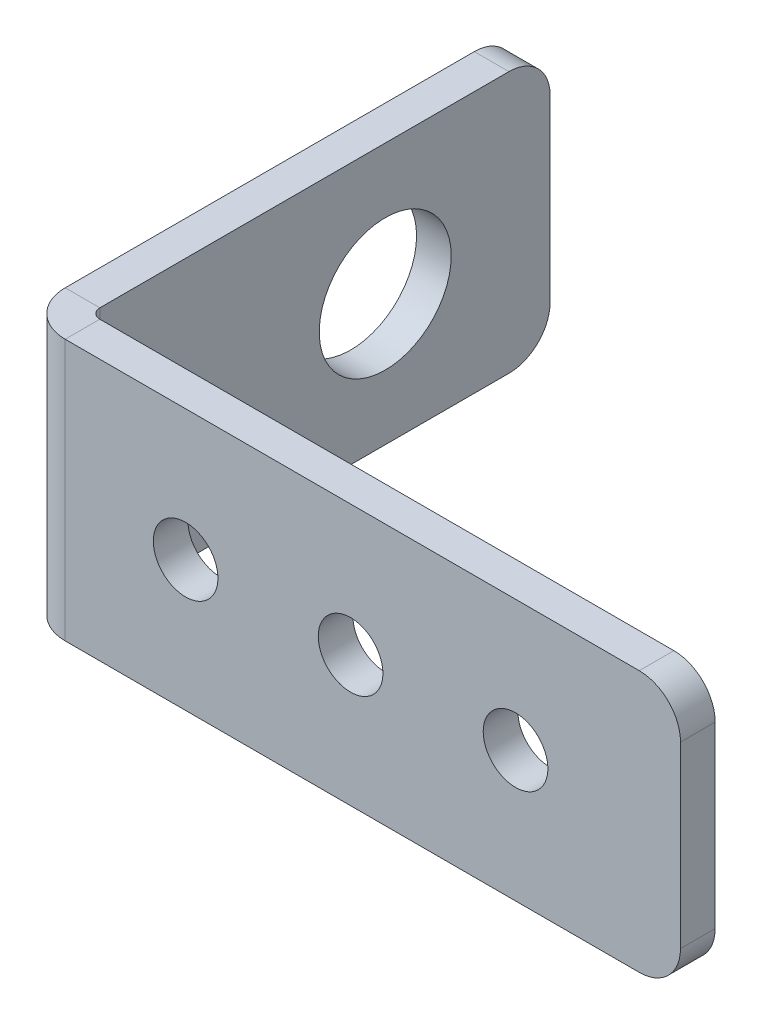
ISO-10303-21;
HEADER;
FILE_DESCRIPTION(('STEP AP214'),'2;1');
FILE_NAME('part.step','',(''),(''),'','','');
FILE_SCHEMA(('AUTOMOTIVE_DESIGN { 1 0 10303 214 1 1 1 1 }'));
ENDSEC;
DATA;
#1=APPLICATION_CONTEXT('core data for automotive mechanical design processes');
#2=APPLICATION_PROTOCOL_DEFINITION('international standard','automotive_design',2000,#1);
#3=PRODUCT_CONTEXT('',#1,'mechanical');
#4=PRODUCT('Part','Part','',(#3));
#5=PRODUCT_RELATED_PRODUCT_CATEGORY('part','',(#4));
#6=PRODUCT_DEFINITION_FORMATION('','',#4);
#7=PRODUCT_DEFINITION_CONTEXT('part definition',#1,'design');
#8=PRODUCT_DEFINITION('design','',#6,#7);
#9=PRODUCT_DEFINITION_SHAPE('','',#8);
#10=(LENGTH_UNIT() NAMED_UNIT(*) SI_UNIT(.MILLI.,.METRE.));
#11=(NAMED_UNIT(*) PLANE_ANGLE_UNIT() SI_UNIT($,.RADIAN.));
#12=(NAMED_UNIT(*) SI_UNIT($,.STERADIAN.) SOLID_ANGLE_UNIT());
#13=UNCERTAINTY_MEASURE_WITH_UNIT(LENGTH_MEASURE(1.E-05),#10,'distance_accuracy_value','');
#14=(GEOMETRIC_REPRESENTATION_CONTEXT(3) GLOBAL_UNCERTAINTY_ASSIGNED_CONTEXT((#13)) GLOBAL_UNIT_ASSIGNED_CONTEXT((#10,
#11,#12)) REPRESENTATION_CONTEXT('',''));
#15=CARTESIAN_POINT('',(0.,0.,0.));
#16=DIRECTION('',(0.,0.,1.));
#17=DIRECTION('',(1.,0.,0.));
#18=AXIS2_PLACEMENT_3D('',#15,#16,#17);
#19=CARTESIAN_POINT('',(0.,20.1168,-3.429));
#20=DIRECTION('',(0.,1.,0.));
#21=DIRECTION('',(0.,0.,1.));
#22=AXIS2_PLACEMENT_3D('',#19,#20,#21);
#23=PLANE('',#22);
#24=DIRECTION('',(1.,0.,0.));
#25=VECTOR('',#24,1.);
#26=CARTESIAN_POINT('',(0.,20.1168,-3.429));
#27=LINE('',#26,#25);
#28=CARTESIAN_POINT('',(0.,20.1168,-3.429));
#29=VERTEX_POINT('',#28);
#30=CARTESIAN_POINT('',(2.667,20.1168,-3.429));
#31=VERTEX_POINT('',#30);
#32=EDGE_CURVE('E138',#29,#31,#27,.T.);
#33=ORIENTED_EDGE('',*,*,#32,.F.);
#34=CARTESIAN_POINT('',(3.429,20.1168,-3.429));
#35=DIRECTION('',(0.,-1.,0.));
#36=DIRECTION('',(0.,0.,-1.));
#37=AXIS2_PLACEMENT_3D('',#34,#35,#36);
#38=CIRCLE('',#37,3.429);
#39=CARTESIAN_POINT('',(3.429,20.1168,0.));
#40=VERTEX_POINT('',#39);
#41=EDGE_CURVE('E133',#29,#40,#38,.F.);
#42=ORIENTED_EDGE('',*,*,#41,.T.);
#43=DIRECTION('',(0.,0.,1.));
#44=VECTOR('',#43,1.);
#45=CARTESIAN_POINT('',(3.429,20.1168,-2.667));
#46=LINE('',#45,#44);
#47=CARTESIAN_POINT('',(3.429,20.1168,-2.667));
#48=VERTEX_POINT('',#47);
#49=EDGE_CURVE('E127',#48,#40,#46,.T.);
#50=ORIENTED_EDGE('',*,*,#49,.F.);
#51=CARTESIAN_POINT('',(3.429,20.1168,-3.429));
#52=DIRECTION('',(0.,1.,0.));
#53=DIRECTION('',(1.,0.,0.));
#54=AXIS2_PLACEMENT_3D('',#51,#52,#53);
#55=CIRCLE('',#54,0.762);
#56=EDGE_CURVE('E131',#31,#48,#55,.T.);
#57=ORIENTED_EDGE('',*,*,#56,.F.);
#58=EDGE_LOOP('',(#33,#42,#50,#57));
#59=FACE_BOUND('',#58,.T.);
#60=ADVANCED_FACE('F37',(#59),#23,.T.);
#61=CARTESIAN_POINT('',(3.429,20.1168,-2.667));
#62=DIRECTION('',(0.,1.,0.));
#63=DIRECTION('',(0.,0.,1.));
#64=AXIS2_PLACEMENT_3D('',#61,#62,#63);
#65=PLANE('',#64);
#66=DIRECTION('',(0.,0.,-1.));
#67=VECTOR('',#66,1.);
#68=CARTESIAN_POINT('',(2.667,20.1168,0.));
#69=LINE('',#68,#67);
#70=CARTESIAN_POINT('',(2.667,20.1168,-34.925));
#71=VERTEX_POINT('',#70);
#72=EDGE_CURVE('E166',#71,#31,#69,.F.);
#73=ORIENTED_EDGE('',*,*,#72,.F.);
#74=DIRECTION('',(1.,0.,0.));
#75=VECTOR('',#74,1.);
#76=CARTESIAN_POINT('',(3.429,20.1168,-34.925));
#77=LINE('',#76,#75);
#78=CARTESIAN_POINT('',(0.,20.1168,-34.925));
#79=VERTEX_POINT('',#78);
#80=EDGE_CURVE('E11',#71,#79,#77,.F.);
#81=ORIENTED_EDGE('',*,*,#80,.T.);
#82=DIRECTION('',(0.,0.,1.));
#83=VECTOR('',#82,1.);
#84=CARTESIAN_POINT('',(0.,20.1168,0.));
#85=LINE('',#84,#83);
#86=EDGE_CURVE('E168',#79,#29,#85,.T.);
#87=ORIENTED_EDGE('',*,*,#86,.T.);
#88=ORIENTED_EDGE('',*,*,#32,.T.);
#89=EDGE_LOOP('',(#73,#81,#87,#88));
#90=FACE_BOUND('',#89,.T.);
#91=ADVANCED_FACE('F257',(#90),#65,.T.);
#92=CARTESIAN_POINT('',(3.429,0.,0.));
#93=DIRECTION('',(0.,-1.,0.));
#94=DIRECTION('',(0.,0.,-1.));
#95=AXIS2_PLACEMENT_3D('',#92,#93,#94);
#96=PLANE('',#95);
#97=DIRECTION('',(0.,0.,-1.));
#98=VECTOR('',#97,1.);
#99=CARTESIAN_POINT('',(3.429,0.,0.));
#100=LINE('',#99,#98);
#101=CARTESIAN_POINT('',(3.429,0.,0.));
#102=VERTEX_POINT('',#101);
#103=CARTESIAN_POINT('',(3.429,0.,-2.667));
#104=VERTEX_POINT('',#103);
#105=EDGE_CURVE('E139',#102,#104,#100,.T.);
#106=ORIENTED_EDGE('',*,*,#105,.F.);
#107=CARTESIAN_POINT('',(3.429,0.,-3.429));
#108=DIRECTION('',(0.,-1.,0.));
#109=DIRECTION('',(0.,0.,-1.));
#110=AXIS2_PLACEMENT_3D('',#107,#108,#109);
#111=CIRCLE('',#110,3.429);
#112=CARTESIAN_POINT('',(0.,0.,-3.429));
#113=VERTEX_POINT('',#112);
#114=EDGE_CURVE('E186',#113,#102,#111,.F.);
#115=ORIENTED_EDGE('',*,*,#114,.F.);
#116=DIRECTION('',(-1.,0.,0.));
#117=VECTOR('',#116,1.);
#118=CARTESIAN_POINT('',(2.667,0.,-3.429));
#119=LINE('',#118,#117);
#120=CARTESIAN_POINT('',(2.667,0.,-3.429));
#121=VERTEX_POINT('',#120);
#122=EDGE_CURVE('E203',#121,#113,#119,.T.);
#123=ORIENTED_EDGE('',*,*,#122,.F.);
#124=CARTESIAN_POINT('',(3.429,0.,-3.429));
#125=DIRECTION('',(0.,1.,0.));
#126=DIRECTION('',(1.,0.,0.));
#127=AXIS2_PLACEMENT_3D('',#124,#125,#126);
#128=CIRCLE('',#127,0.762);
#129=EDGE_CURVE('E180',#121,#104,#128,.T.);
#130=ORIENTED_EDGE('',*,*,#129,.T.);
#131=EDGE_LOOP('',(#106,#115,#123,#130));
#132=FACE_BOUND('',#131,.T.);
#133=ADVANCED_FACE('F313',(#132),#96,.T.);
#134=CARTESIAN_POINT('',(2.667,0.,-3.429));
#135=DIRECTION('',(0.,-1.,0.));
#136=DIRECTION('',(0.,0.,-1.));
#137=AXIS2_PLACEMENT_3D('',#134,#135,#136);
#138=PLANE('',#137);
#139=DIRECTION('',(1.,0.,0.));
#140=VECTOR('',#139,1.);
#141=CARTESIAN_POINT('',(0.,0.,-2.667));
#142=LINE('',#141,#140);
#143=CARTESIAN_POINT('',(47.625,0.,-2.667));
#144=VERTEX_POINT('',#143);
#145=EDGE_CURVE('E151',#104,#144,#142,.T.);
#146=ORIENTED_EDGE('',*,*,#145,.T.);
#147=DIRECTION('',(0.,0.,1.));
#148=VECTOR('',#147,1.);
#149=CARTESIAN_POINT('',(47.625,0.,-3.429));
#150=LINE('',#149,#148);
#151=CARTESIAN_POINT('',(47.625,0.,0.));
#152=VERTEX_POINT('',#151);
#153=EDGE_CURVE('E209',#144,#152,#150,.T.);
#154=ORIENTED_EDGE('',*,*,#153,.T.);
#155=DIRECTION('',(1.,0.,0.));
#156=VECTOR('',#155,1.);
#157=CARTESIAN_POINT('',(0.,0.,0.));
#158=LINE('',#157,#156);
#159=EDGE_CURVE('E175',#102,#152,#158,.T.);
#160=ORIENTED_EDGE('',*,*,#159,.F.);
#161=ORIENTED_EDGE('',*,*,#105,.T.);
#162=EDGE_LOOP('',(#146,#154,#160,#161));
#163=FACE_BOUND('',#162,.T.);
#164=ADVANCED_FACE('F421',(#163),#138,.T.);
#165=CARTESIAN_POINT('',(0.,20.1168,0.));
#166=DIRECTION('',(0.,0.,-1.));
#167=DIRECTION('',(-1.,0.,0.));
#168=AXIS2_PLACEMENT_3D('',#165,#166,#167);
#169=PLANE('',#168);
#170=CARTESIAN_POINT('',(38.1,10.0584,0.));
#171=DIRECTION('',(0.,0.,-1.));
#172=DIRECTION('',(-1.,0.,0.));
#173=AXIS2_PLACEMENT_3D('',#170,#171,#172);
#174=CIRCLE('',#173,2.4892);
#175=CARTESIAN_POINT('',(35.6108,10.0584,0.));
#176=VERTEX_POINT('',#175);
#177=EDGE_CURVE('E178',#176,#176,#174,.T.);
#178=ORIENTED_EDGE('',*,*,#177,.T.);
#179=EDGE_LOOP('',(#178));
#180=FACE_BOUND('',#179,.T.);
#181=CARTESIAN_POINT('',(25.4,10.0584,0.));
#182=DIRECTION('',(0.,0.,-1.));
#183=DIRECTION('',(-1.,0.,0.));
#184=AXIS2_PLACEMENT_3D('',#181,#182,#183);
#185=CIRCLE('',#184,2.4892);
#186=CARTESIAN_POINT('',(22.9108,10.0584,0.));
#187=VERTEX_POINT('',#186);
#188=EDGE_CURVE('E277',#187,#187,#185,.T.);
#189=ORIENTED_EDGE('',*,*,#188,.T.);
#190=EDGE_LOOP('',(#189));
#191=FACE_BOUND('',#190,.T.);
#192=CARTESIAN_POINT('',(12.7,10.0584,0.));
#193=DIRECTION('',(0.,0.,-1.));
#194=DIRECTION('',(-1.,0.,0.));
#195=AXIS2_PLACEMENT_3D('',#192,#193,#194);
#196=CIRCLE('',#195,2.4892);
#197=CARTESIAN_POINT('',(10.2108,10.0584,0.));
#198=VERTEX_POINT('',#197);
#199=EDGE_CURVE('E270',#198,#198,#196,.T.);
#200=ORIENTED_EDGE('',*,*,#199,.T.);
#201=EDGE_LOOP('',(#200));
#202=FACE_BOUND('',#201,.T.);
#203=ORIENTED_EDGE('',*,*,#159,.T.);
#204=CARTESIAN_POINT('',(47.625,3.175,0.));
#205=DIRECTION('',(0.,0.,-1.));
#206=DIRECTION('',(-1.,0.,0.));
#207=AXIS2_PLACEMENT_3D('',#204,#205,#206);
#208=CIRCLE('',#207,3.175);
#209=CARTESIAN_POINT('',(50.8,3.175,0.));
#210=VERTEX_POINT('',#209);
#211=EDGE_CURVE('E214',#152,#210,#208,.F.);
#212=ORIENTED_EDGE('',*,*,#211,.T.);
#213=DIRECTION('',(0.,-1.,0.));
#214=VECTOR('',#213,1.);
#215=CARTESIAN_POINT('',(50.8,20.1168,0.));
#216=LINE('',#215,#214);
#217=CARTESIAN_POINT('',(50.8,16.9418,0.));
#218=VERTEX_POINT('',#217);
#219=EDGE_CURVE('E200',#218,#210,#216,.T.);
#220=ORIENTED_EDGE('',*,*,#219,.F.);
#221=CARTESIAN_POINT('',(47.625,16.9418,0.));
#222=DIRECTION('',(0.,0.,-1.));
#223=DIRECTION('',(-1.,0.,0.));
#224=AXIS2_PLACEMENT_3D('',#221,#222,#223);
#225=CIRCLE('',#224,3.175);
#226=CARTESIAN_POINT('',(47.625,20.1168,0.));
#227=VERTEX_POINT('',#226);
#228=EDGE_CURVE('E212',#218,#227,#225,.F.);
#229=ORIENTED_EDGE('',*,*,#228,.T.);
#230=DIRECTION('',(1.,0.,0.));
#231=VECTOR('',#230,1.);
#232=CARTESIAN_POINT('',(0.,20.1168,0.));
#233=LINE('',#232,#231);
#234=EDGE_CURVE('E161',#40,#227,#233,.T.);
#235=ORIENTED_EDGE('',*,*,#234,.F.);
#236=DIRECTION('',(0.,-1.,0.));
#237=VECTOR('',#236,1.);
#238=CARTESIAN_POINT('',(3.429,20.1168,0.));
#239=LINE('',#238,#237);
#240=EDGE_CURVE('E174',#40,#102,#239,.T.);
#241=ORIENTED_EDGE('',*,*,#240,.T.);
#242=EDGE_LOOP('',(#203,#212,#220,#229,#235,#241));
#243=FACE_BOUND('',#242,.T.);
#244=ADVANCED_FACE('F264',(#180,#191,#202,#243),#169,.F.);
#245=CARTESIAN_POINT('',(50.8,20.1168,-2.667));
#246=DIRECTION('',(1.,0.,0.));
#247=DIRECTION('',(0.,0.,-1.));
#248=AXIS2_PLACEMENT_3D('',#245,#246,#247);
#249=PLANE('',#248);
#250=ORIENTED_EDGE('',*,*,#219,.T.);
#251=DIRECTION('',(0.,0.,1.));
#252=VECTOR('',#251,1.);
#253=CARTESIAN_POINT('',(50.8,3.175,-2.667));
#254=LINE('',#253,#252);
#255=CARTESIAN_POINT('',(50.8,3.175,-2.667));
#256=VERTEX_POINT('',#255);
#257=EDGE_CURVE('E219',#210,#256,#254,.F.);
#258=ORIENTED_EDGE('',*,*,#257,.T.);
#259=DIRECTION('',(0.,-1.,0.));
#260=VECTOR('',#259,1.);
#261=CARTESIAN_POINT('',(50.8,20.1168,-2.667));
#262=LINE('',#261,#260);
#263=CARTESIAN_POINT('',(50.8,16.9418,-2.667));
#264=VERTEX_POINT('',#263);
#265=EDGE_CURVE('E155',#264,#256,#262,.T.);
#266=ORIENTED_EDGE('',*,*,#265,.F.);
#267=DIRECTION('',(0.,0.,1.));
#268=VECTOR('',#267,1.);
#269=CARTESIAN_POINT('',(50.8,16.9418,-2.667));
#270=LINE('',#269,#268);
#271=EDGE_CURVE('E216',#264,#218,#270,.T.);
#272=ORIENTED_EDGE('',*,*,#271,.T.);
#273=EDGE_LOOP('',(#250,#258,#266,#272));
#274=FACE_BOUND('',#273,.T.);
#275=ADVANCED_FACE('F400',(#274),#249,.T.);
#276=CARTESIAN_POINT('',(0.,20.1168,-2.667));
#277=DIRECTION('',(0.,0.,-1.));
#278=DIRECTION('',(-1.,0.,0.));
#279=AXIS2_PLACEMENT_3D('',#276,#277,#278);
#280=PLANE('',#279);
#281=CARTESIAN_POINT('',(38.1,10.0584,-2.667));
#282=DIRECTION('',(0.,0.,-1.));
#283=DIRECTION('',(-1.,0.,0.));
#284=AXIS2_PLACEMENT_3D('',#281,#282,#283);
#285=CIRCLE('',#284,2.4892);
#286=CARTESIAN_POINT('',(35.6108,10.0584,-2.667));
#287=VERTEX_POINT('',#286);
#288=EDGE_CURVE('E280',#287,#287,#285,.T.);
#289=ORIENTED_EDGE('',*,*,#288,.F.);
#290=EDGE_LOOP('',(#289));
#291=FACE_BOUND('',#290,.T.);
#292=CARTESIAN_POINT('',(25.4,10.0584,-2.667));
#293=DIRECTION('',(0.,0.,-1.));
#294=DIRECTION('',(-1.,0.,0.));
#295=AXIS2_PLACEMENT_3D('',#292,#293,#294);
#296=CIRCLE('',#295,2.4892);
#297=CARTESIAN_POINT('',(22.9108,10.0584,-2.667));
#298=VERTEX_POINT('',#297);
#299=EDGE_CURVE('E274',#298,#298,#296,.T.);
#300=ORIENTED_EDGE('',*,*,#299,.F.);
#301=EDGE_LOOP('',(#300));
#302=FACE_BOUND('',#301,.T.);
#303=CARTESIAN_POINT('',(12.7,10.0584,-2.667));
#304=DIRECTION('',(0.,0.,-1.));
#305=DIRECTION('',(-1.,0.,0.));
#306=AXIS2_PLACEMENT_3D('',#303,#304,#305);
#307=CIRCLE('',#306,2.4892);
#308=CARTESIAN_POINT('',(10.2108,10.0584,-2.667));
#309=VERTEX_POINT('',#308);
#310=EDGE_CURVE('E267',#309,#309,#307,.T.);
#311=ORIENTED_EDGE('',*,*,#310,.F.);
#312=EDGE_LOOP('',(#311));
#313=FACE_BOUND('',#312,.T.);
#314=ORIENTED_EDGE('',*,*,#265,.T.);
#315=CARTESIAN_POINT('',(47.625,3.175,-2.667));
#316=DIRECTION('',(0.,0.,-1.));
#317=DIRECTION('',(-1.,0.,0.));
#318=AXIS2_PLACEMENT_3D('',#315,#316,#317);
#319=CIRCLE('',#318,3.175);
#320=EDGE_CURVE('E223',#256,#144,#319,.T.);
#321=ORIENTED_EDGE('',*,*,#320,.T.);
#322=ORIENTED_EDGE('',*,*,#145,.F.);
#323=DIRECTION('',(0.,-1.,0.));
#324=VECTOR('',#323,1.);
#325=CARTESIAN_POINT('',(3.429,20.1168,-2.667));
#326=LINE('',#325,#324);
#327=EDGE_CURVE('E145',#48,#104,#326,.T.);
#328=ORIENTED_EDGE('',*,*,#327,.F.);
#329=DIRECTION('',(1.,0.,0.));
#330=VECTOR('',#329,1.);
#331=CARTESIAN_POINT('',(0.,20.1168,-2.667));
#332=LINE('',#331,#330);
#333=CARTESIAN_POINT('',(47.625,20.1168,-2.667));
#334=VERTEX_POINT('',#333);
#335=EDGE_CURVE('E148',#48,#334,#332,.T.);
#336=ORIENTED_EDGE('',*,*,#335,.T.);
#337=CARTESIAN_POINT('',(47.625,16.9418,-2.667));
#338=DIRECTION('',(0.,0.,-1.));
#339=DIRECTION('',(-1.,0.,0.));
#340=AXIS2_PLACEMENT_3D('',#337,#338,#339);
#341=CIRCLE('',#340,3.175);
#342=EDGE_CURVE('E221',#334,#264,#341,.T.);
#343=ORIENTED_EDGE('',*,*,#342,.T.);
#344=EDGE_LOOP('',(#314,#321,#322,#328,#336,#343));
#345=FACE_BOUND('',#344,.T.);
#346=ADVANCED_FACE('F147',(#291,#302,#313,#345),#280,.T.);
#347=CARTESIAN_POINT('',(3.429,20.1168,-3.429));
#348=DIRECTION('',(0.,-1.,0.));
#349=DIRECTION('',(0.,0.,-1.));
#350=AXIS2_PLACEMENT_3D('',#347,#348,#349);
#351=CYLINDRICAL_SURFACE('',#350,0.762);
#352=ORIENTED_EDGE('',*,*,#129,.F.);
#353=DIRECTION('',(0.,-1.,0.));
#354=VECTOR('',#353,1.);
#355=CARTESIAN_POINT('',(2.667,20.1168,-3.429));
#356=LINE('',#355,#354);
#357=EDGE_CURVE('E156',#31,#121,#356,.T.);
#358=ORIENTED_EDGE('',*,*,#357,.F.);
#359=ORIENTED_EDGE('',*,*,#56,.T.);
#360=ORIENTED_EDGE('',*,*,#327,.T.);
#361=EDGE_LOOP('',(#352,#358,#359,#360));
#362=FACE_BOUND('',#361,.T.);
#363=ADVANCED_FACE('F164',(#362),#351,.F.);
#364=CARTESIAN_POINT('',(2.667,20.1168,0.));
#365=DIRECTION('',(1.,0.,0.));
#366=DIRECTION('',(0.,0.,-1.));
#367=AXIS2_PLACEMENT_3D('',#364,#365,#366);
#368=PLANE('',#367);
#369=CARTESIAN_POINT('',(2.667,10.0584,-25.4));
#370=DIRECTION('',(1.,0.,0.));
#371=DIRECTION('',(0.,0.,-1.));
#372=AXIS2_PLACEMENT_3D('',#369,#370,#371);
#373=CIRCLE('',#372,5.08);
#374=CARTESIAN_POINT('',(2.667,10.0584,-30.48));
#375=VERTEX_POINT('',#374);
#376=EDGE_CURVE('E285',#375,#375,#373,.T.);
#377=ORIENTED_EDGE('',*,*,#376,.F.);
#378=EDGE_LOOP('',(#377));
#379=FACE_BOUND('',#378,.T.);
#380=DIRECTION('',(0.,0.,-1.));
#381=VECTOR('',#380,1.);
#382=CARTESIAN_POINT('',(2.667,0.,0.));
#383=LINE('',#382,#381);
#384=CARTESIAN_POINT('',(2.667,0.,-34.925));
#385=VERTEX_POINT('',#384);
#386=EDGE_CURVE('E182',#385,#121,#383,.F.);
#387=ORIENTED_EDGE('',*,*,#386,.F.);
#388=CARTESIAN_POINT('',(2.667,3.175,-34.925));
#389=DIRECTION('',(1.,0.,0.));
#390=DIRECTION('',(0.,0.,-1.));
#391=AXIS2_PLACEMENT_3D('',#388,#389,#390);
#392=CIRCLE('',#391,3.175);
#393=CARTESIAN_POINT('',(2.667,3.175,-38.1));
#394=VERTEX_POINT('',#393);
#395=EDGE_CURVE('E231',#385,#394,#392,.T.);
#396=ORIENTED_EDGE('',*,*,#395,.T.);
#397=DIRECTION('',(0.,-1.,0.));
#398=VECTOR('',#397,1.);
#399=CARTESIAN_POINT('',(2.667,20.1168,-38.1));
#400=LINE('',#399,#398);
#401=CARTESIAN_POINT('',(2.667,16.9418,-38.1));
#402=VERTEX_POINT('',#401);
#403=EDGE_CURVE('E196',#402,#394,#400,.T.);
#404=ORIENTED_EDGE('',*,*,#403,.F.);
#405=CARTESIAN_POINT('',(2.667,16.9418,-34.925));
#406=DIRECTION('',(1.,0.,0.));
#407=DIRECTION('',(0.,0.,-1.));
#408=AXIS2_PLACEMENT_3D('',#405,#406,#407);
#409=CIRCLE('',#408,3.175);
#410=EDGE_CURVE('E229',#402,#71,#409,.T.);
#411=ORIENTED_EDGE('',*,*,#410,.T.);
#412=ORIENTED_EDGE('',*,*,#72,.T.);
#413=ORIENTED_EDGE('',*,*,#357,.T.);
#414=EDGE_LOOP('',(#387,#396,#404,#411,#412,#413));
#415=FACE_BOUND('',#414,.T.);
#416=ADVANCED_FACE('F252',(#379,#415),#368,.T.);
#417=CARTESIAN_POINT('',(0.,20.1168,-38.1));
#418=DIRECTION('',(0.,0.,-1.));
#419=DIRECTION('',(-1.,0.,0.));
#420=AXIS2_PLACEMENT_3D('',#417,#418,#419);
#421=PLANE('',#420);
#422=ORIENTED_EDGE('',*,*,#403,.T.);
#423=DIRECTION('',(1.,0.,0.));
#424=VECTOR('',#423,1.);
#425=CARTESIAN_POINT('',(0.,3.175,-38.1));
#426=LINE('',#425,#424);
#427=CARTESIAN_POINT('',(0.,3.175,-38.1));
#428=VERTEX_POINT('',#427);
#429=EDGE_CURVE('E58',#394,#428,#426,.F.);
#430=ORIENTED_EDGE('',*,*,#429,.T.);
#431=DIRECTION('',(0.,-1.,0.));
#432=VECTOR('',#431,1.);
#433=CARTESIAN_POINT('',(0.,20.1168,-38.1));
#434=LINE('',#433,#432);
#435=CARTESIAN_POINT('',(0.,16.9418,-38.1));
#436=VERTEX_POINT('',#435);
#437=EDGE_CURVE('E194',#436,#428,#434,.T.);
#438=ORIENTED_EDGE('',*,*,#437,.F.);
#439=DIRECTION('',(1.,0.,0.));
#440=VECTOR('',#439,1.);
#441=CARTESIAN_POINT('',(0.,16.9418,-38.1));
#442=LINE('',#441,#440);
#443=EDGE_CURVE('E233',#436,#402,#442,.T.);
#444=ORIENTED_EDGE('',*,*,#443,.T.);
#445=EDGE_LOOP('',(#422,#430,#438,#444));
#446=FACE_BOUND('',#445,.T.);
#447=ADVANCED_FACE('F253',(#446),#421,.T.);
#448=CARTESIAN_POINT('',(0.,20.1168,0.));
#449=DIRECTION('',(1.,0.,0.));
#450=DIRECTION('',(0.,0.,-1.));
#451=AXIS2_PLACEMENT_3D('',#448,#449,#450);
#452=PLANE('',#451);
#453=CARTESIAN_POINT('',(0.,10.0584,-25.4));
#454=DIRECTION('',(1.,0.,0.));
#455=DIRECTION('',(0.,0.,-1.));
#456=AXIS2_PLACEMENT_3D('',#453,#454,#455);
#457=CIRCLE('',#456,5.08);
#458=CARTESIAN_POINT('',(0.,10.0584,-30.48));
#459=VERTEX_POINT('',#458);
#460=EDGE_CURVE('E271',#459,#459,#457,.T.);
#461=ORIENTED_EDGE('',*,*,#460,.T.);
#462=EDGE_LOOP('',(#461));
#463=FACE_BOUND('',#462,.T.);
#464=ORIENTED_EDGE('',*,*,#437,.T.);
#465=CARTESIAN_POINT('',(0.,3.175,-34.925));
#466=DIRECTION('',(1.,0.,0.));
#467=DIRECTION('',(0.,0.,-1.));
#468=AXIS2_PLACEMENT_3D('',#465,#466,#467);
#469=CIRCLE('',#468,3.175);
#470=CARTESIAN_POINT('',(0.,0.,-34.925));
#471=VERTEX_POINT('',#470);
#472=EDGE_CURVE('E45',#428,#471,#469,.F.);
#473=ORIENTED_EDGE('',*,*,#472,.T.);
#474=DIRECTION('',(0.,0.,1.));
#475=VECTOR('',#474,1.);
#476=CARTESIAN_POINT('',(0.,0.,0.));
#477=LINE('',#476,#475);
#478=EDGE_CURVE('E184',#471,#113,#477,.T.);
#479=ORIENTED_EDGE('',*,*,#478,.T.);
#480=DIRECTION('',(0.,-1.,0.));
#481=VECTOR('',#480,1.);
#482=CARTESIAN_POINT('',(0.,20.1168,-3.429));
#483=LINE('',#482,#481);
#484=EDGE_CURVE('E191',#29,#113,#483,.T.);
#485=ORIENTED_EDGE('',*,*,#484,.F.);
#486=ORIENTED_EDGE('',*,*,#86,.F.);
#487=CARTESIAN_POINT('',(0.,16.9418,-34.925));
#488=DIRECTION('',(1.,0.,0.));
#489=DIRECTION('',(0.,0.,-1.));
#490=AXIS2_PLACEMENT_3D('',#487,#488,#489);
#491=CIRCLE('',#490,3.175);
#492=EDGE_CURVE('E237',#79,#436,#491,.F.);
#493=ORIENTED_EDGE('',*,*,#492,.T.);
#494=EDGE_LOOP('',(#464,#473,#479,#485,#486,#493));
#495=FACE_BOUND('',#494,.T.);
#496=ADVANCED_FACE('F241',(#463,#495),#452,.F.);
#497=CARTESIAN_POINT('',(3.429,20.1168,-3.429));
#498=DIRECTION('',(0.,-1.,0.));
#499=DIRECTION('',(0.,0.,-1.));
#500=AXIS2_PLACEMENT_3D('',#497,#498,#499);
#501=CYLINDRICAL_SURFACE('',#500,3.429);
#502=ORIENTED_EDGE('',*,*,#114,.T.);
#503=ORIENTED_EDGE('',*,*,#240,.F.);
#504=ORIENTED_EDGE('',*,*,#41,.F.);
#505=ORIENTED_EDGE('',*,*,#484,.T.);
#506=EDGE_LOOP('',(#502,#503,#504,#505));
#507=FACE_BOUND('',#506,.T.);
#508=ADVANCED_FACE('F260',(#507),#501,.T.);
#509=CARTESIAN_POINT('',(3.429,20.1168,-3.429));
#510=DIRECTION('',(0.,1.,0.));
#511=DIRECTION('',(1.,0.,0.));
#512=AXIS2_PLACEMENT_3D('',#509,#510,#511);
#513=PLANE('',#512);
#514=ORIENTED_EDGE('',*,*,#234,.T.);
#515=DIRECTION('',(0.,0.,1.));
#516=VECTOR('',#515,1.);
#517=CARTESIAN_POINT('',(47.625,20.1168,-3.429));
#518=LINE('',#517,#516);
#519=EDGE_CURVE('E160',#227,#334,#518,.F.);
#520=ORIENTED_EDGE('',*,*,#519,.T.);
#521=ORIENTED_EDGE('',*,*,#335,.F.);
#522=ORIENTED_EDGE('',*,*,#49,.T.);
#523=EDGE_LOOP('',(#514,#520,#521,#522));
#524=FACE_BOUND('',#523,.T.);
#525=ADVANCED_FACE('F158',(#524),#513,.T.);
#526=CARTESIAN_POINT('',(3.429,0.,-3.429));
#527=DIRECTION('',(0.,1.,0.));
#528=DIRECTION('',(1.,0.,0.));
#529=AXIS2_PLACEMENT_3D('',#526,#527,#528);
#530=PLANE('',#529);
#531=ORIENTED_EDGE('',*,*,#478,.F.);
#532=DIRECTION('',(1.,0.,0.));
#533=VECTOR('',#532,1.);
#534=CARTESIAN_POINT('',(2.667,0.,-34.925));
#535=LINE('',#534,#533);
#536=EDGE_CURVE('E226',#471,#385,#535,.T.);
#537=ORIENTED_EDGE('',*,*,#536,.T.);
#538=ORIENTED_EDGE('',*,*,#386,.T.);
#539=ORIENTED_EDGE('',*,*,#122,.T.);
#540=EDGE_LOOP('',(#531,#537,#538,#539));
#541=FACE_BOUND('',#540,.T.);
#542=ADVANCED_FACE('F246',(#541),#530,.F.);
#543=CARTESIAN_POINT('',(12.7,10.0584,0.));
#544=DIRECTION('',(0.,0.,-1.));
#545=DIRECTION('',(-1.,0.,0.));
#546=AXIS2_PLACEMENT_3D('',#543,#544,#545);
#547=CYLINDRICAL_SURFACE('',#546,2.4892);
#548=ORIENTED_EDGE('',*,*,#199,.F.);
#549=EDGE_LOOP('',(#548));
#550=FACE_BOUND('',#549,.T.);
#551=ORIENTED_EDGE('',*,*,#310,.T.);
#552=EDGE_LOOP('',(#551));
#553=FACE_BOUND('',#552,.T.);
#554=ADVANCED_FACE('F355',(#550,#553),#547,.F.);
#555=CARTESIAN_POINT('',(25.4,10.0584,0.));
#556=DIRECTION('',(0.,0.,-1.));
#557=DIRECTION('',(-1.,0.,0.));
#558=AXIS2_PLACEMENT_3D('',#555,#556,#557);
#559=CYLINDRICAL_SURFACE('',#558,2.4892);
#560=ORIENTED_EDGE('',*,*,#188,.F.);
#561=EDGE_LOOP('',(#560));
#562=FACE_BOUND('',#561,.T.);
#563=ORIENTED_EDGE('',*,*,#299,.T.);
#564=EDGE_LOOP('',(#563));
#565=FACE_BOUND('',#564,.T.);
#566=ADVANCED_FACE('F458',(#562,#565),#559,.F.);
#567=CARTESIAN_POINT('',(38.1,10.0584,0.));
#568=DIRECTION('',(0.,0.,-1.));
#569=DIRECTION('',(-1.,0.,0.));
#570=AXIS2_PLACEMENT_3D('',#567,#568,#569);
#571=CYLINDRICAL_SURFACE('',#570,2.4892);
#572=ORIENTED_EDGE('',*,*,#177,.F.);
#573=EDGE_LOOP('',(#572));
#574=FACE_BOUND('',#573,.T.);
#575=ORIENTED_EDGE('',*,*,#288,.T.);
#576=EDGE_LOOP('',(#575));
#577=FACE_BOUND('',#576,.T.);
#578=ADVANCED_FACE('F296',(#574,#577),#571,.F.);
#579=CARTESIAN_POINT('',(0.,10.0584,-25.4));
#580=DIRECTION('',(1.,0.,0.));
#581=DIRECTION('',(0.,0.,-1.));
#582=AXIS2_PLACEMENT_3D('',#579,#580,#581);
#583=CYLINDRICAL_SURFACE('',#582,5.08);
#584=ORIENTED_EDGE('',*,*,#460,.F.);
#585=EDGE_LOOP('',(#584));
#586=FACE_BOUND('',#585,.T.);
#587=ORIENTED_EDGE('',*,*,#376,.T.);
#588=EDGE_LOOP('',(#587));
#589=FACE_BOUND('',#588,.T.);
#590=ADVANCED_FACE('F292',(#586,#589),#583,.F.);
#591=CARTESIAN_POINT('',(47.625,3.175,-3.429));
#592=DIRECTION('',(0.,0.,1.));
#593=DIRECTION('',(1.,0.,0.));
#594=AXIS2_PLACEMENT_3D('',#591,#592,#593);
#595=CYLINDRICAL_SURFACE('',#594,3.175);
#596=ORIENTED_EDGE('',*,*,#320,.F.);
#597=ORIENTED_EDGE('',*,*,#257,.F.);
#598=ORIENTED_EDGE('',*,*,#211,.F.);
#599=ORIENTED_EDGE('',*,*,#153,.F.);
#600=EDGE_LOOP('',(#596,#597,#598,#599));
#601=FACE_BOUND('',#600,.T.);
#602=ADVANCED_FACE('F295',(#601),#595,.T.);
#603=CARTESIAN_POINT('',(47.625,16.9418,-2.667));
#604=DIRECTION('',(0.,0.,1.));
#605=DIRECTION('',(1.,0.,0.));
#606=AXIS2_PLACEMENT_3D('',#603,#604,#605);
#607=CYLINDRICAL_SURFACE('',#606,3.175);
#608=ORIENTED_EDGE('',*,*,#342,.F.);
#609=ORIENTED_EDGE('',*,*,#519,.F.);
#610=ORIENTED_EDGE('',*,*,#228,.F.);
#611=ORIENTED_EDGE('',*,*,#271,.F.);
#612=EDGE_LOOP('',(#608,#609,#610,#611));
#613=FACE_BOUND('',#612,.T.);
#614=ADVANCED_FACE('F319',(#613),#607,.T.);
#615=CARTESIAN_POINT('',(3.429,3.175,-34.925));
#616=DIRECTION('',(-1.,0.,0.));
#617=DIRECTION('',(0.,0.,1.));
#618=AXIS2_PLACEMENT_3D('',#615,#616,#617);
#619=CYLINDRICAL_SURFACE('',#618,3.175);
#620=ORIENTED_EDGE('',*,*,#472,.F.);
#621=ORIENTED_EDGE('',*,*,#429,.F.);
#622=ORIENTED_EDGE('',*,*,#395,.F.);
#623=ORIENTED_EDGE('',*,*,#536,.F.);
#624=EDGE_LOOP('',(#620,#621,#622,#623));
#625=FACE_BOUND('',#624,.T.);
#626=ADVANCED_FACE('F249',(#625),#619,.T.);
#627=CARTESIAN_POINT('',(0.,16.9418,-34.925));
#628=DIRECTION('',(1.,0.,0.));
#629=DIRECTION('',(0.,0.,-1.));
#630=AXIS2_PLACEMENT_3D('',#627,#628,#629);
#631=CYLINDRICAL_SURFACE('',#630,3.175);
#632=ORIENTED_EDGE('',*,*,#492,.F.);
#633=ORIENTED_EDGE('',*,*,#80,.F.);
#634=ORIENTED_EDGE('',*,*,#410,.F.);
#635=ORIENTED_EDGE('',*,*,#443,.F.);
#636=EDGE_LOOP('',(#632,#633,#634,#635));
#637=FACE_BOUND('',#636,.T.);
#638=ADVANCED_FACE('F39',(#637),#631,.T.);
#639=CLOSED_SHELL('',(#60,#91,#133,#164,#244,#275,#346,#363,#416,#447,#496,#508,#525,#542,#554,
#566,#578,#590,#602,#614,#626,#638));
#640=MANIFOLD_SOLID_BREP('B2',#639);
#641=ADVANCED_BREP_SHAPE_REPRESENTATION('',(#18,#640),#14);
#642=SHAPE_DEFINITION_REPRESENTATION(#9,#641);
ENDSEC;
END-ISO-10303-21;
